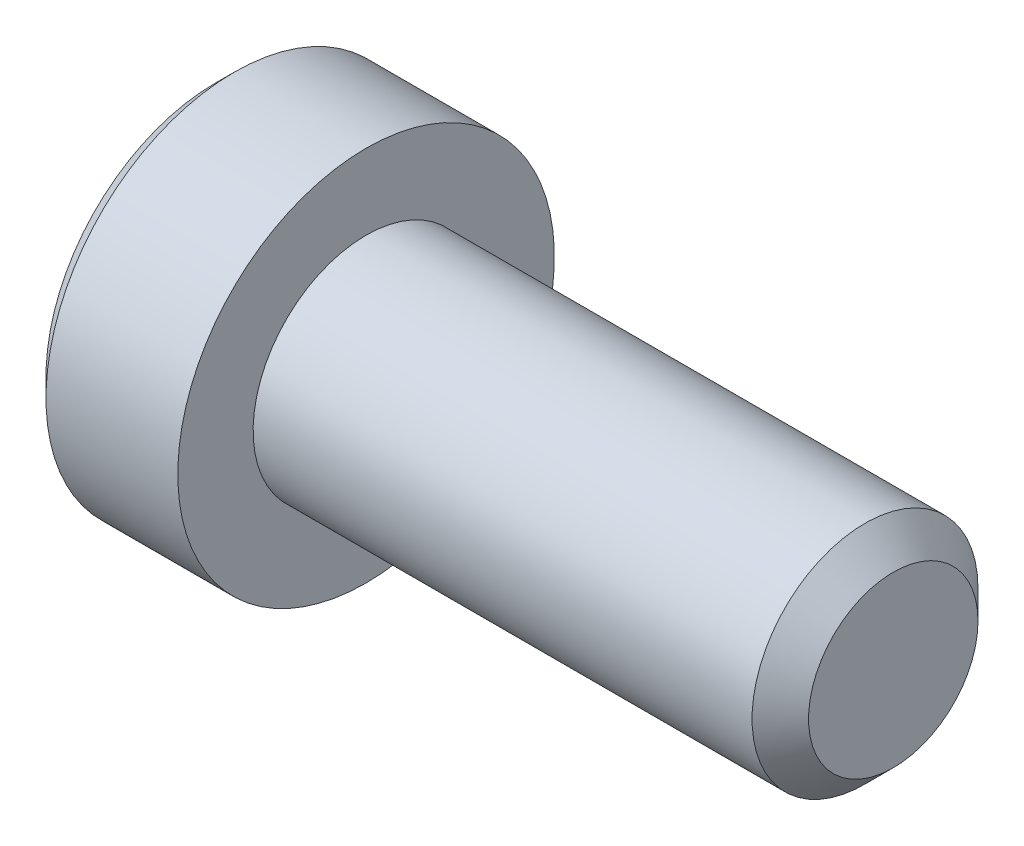
ISO-10303-21;
HEADER;
FILE_DESCRIPTION(('STEP AP214'),'2;1');
FILE_NAME('part.step','',(''),(''),'','','');
FILE_SCHEMA(('AUTOMOTIVE_DESIGN { 1 0 10303 214 1 1 1 1 }'));
ENDSEC;
DATA;
#1=APPLICATION_CONTEXT('core data for automotive mechanical design processes');
#2=APPLICATION_PROTOCOL_DEFINITION('international standard','automotive_design',2000,#1);
#3=PRODUCT_CONTEXT('',#1,'mechanical');
#4=PRODUCT('Part','Part','',(#3));
#5=PRODUCT_RELATED_PRODUCT_CATEGORY('part','',(#4));
#6=PRODUCT_DEFINITION_FORMATION('','',#4);
#7=PRODUCT_DEFINITION_CONTEXT('part definition',#1,'design');
#8=PRODUCT_DEFINITION('design','',#6,#7);
#9=PRODUCT_DEFINITION_SHAPE('','',#8);
#10=(LENGTH_UNIT() NAMED_UNIT(*) SI_UNIT(.MILLI.,.METRE.));
#11=(NAMED_UNIT(*) PLANE_ANGLE_UNIT() SI_UNIT($,.RADIAN.));
#12=(NAMED_UNIT(*) SI_UNIT($,.STERADIAN.) SOLID_ANGLE_UNIT());
#13=UNCERTAINTY_MEASURE_WITH_UNIT(LENGTH_MEASURE(1.E-05),#10,'distance_accuracy_value','');
#14=(GEOMETRIC_REPRESENTATION_CONTEXT(3) GLOBAL_UNCERTAINTY_ASSIGNED_CONTEXT((#13)) GLOBAL_UNIT_ASSIGNED_CONTEXT((#10,
#11,#12)) REPRESENTATION_CONTEXT('',''));
#15=CARTESIAN_POINT('',(0.,0.,0.));
#16=DIRECTION('',(0.,0.,1.));
#17=DIRECTION('',(1.,0.,0.));
#18=AXIS2_PLACEMENT_3D('',#15,#16,#17);
#19=CARTESIAN_POINT('',(-11.,4.49999999999999,0.));
#20=DIRECTION('',(-1.,0.,0.));
#21=DIRECTION('',(0.,-1.,0.));
#22=AXIS2_PLACEMENT_3D('',#19,#20,#21);
#23=PLANE('',#22);
#24=CARTESIAN_POINT('',(-11.,0.,0.));
#25=DIRECTION('',(-1.,0.,0.));
#26=DIRECTION('',(0.,-1.,0.));
#27=AXIS2_PLACEMENT_3D('',#24,#25,#26);
#28=CIRCLE('',#27,2.30940107675845);
#29=CARTESIAN_POINT('',(-11.,-2.30940107675842,-1.43331527202584E-13));
#30=VERTEX_POINT('',#29);
#31=CARTESIAN_POINT('',(-11.,-1.15470053837932,1.99999999999988));
#32=VERTEX_POINT('',#31);
#33=EDGE_CURVE('E131',#30,#32,#28,.T.);
#34=ORIENTED_EDGE('',*,*,#33,.F.);
#35=CARTESIAN_POINT('',(-11.,-1.15470053837925,-2.));
#36=VERTEX_POINT('',#35);
#37=EDGE_CURVE('E130',#36,#30,#28,.T.);
#38=ORIENTED_EDGE('',*,*,#37,.F.);
#39=CARTESIAN_POINT('',(-11.,1.15470053837917,-2.));
#40=VERTEX_POINT('',#39);
#41=EDGE_CURVE('E100',#40,#36,#28,.T.);
#42=ORIENTED_EDGE('',*,*,#41,.F.);
#43=CARTESIAN_POINT('',(-11.,2.30940107675848,0.));
#44=VERTEX_POINT('',#43);
#45=EDGE_CURVE('E93',#44,#40,#28,.T.);
#46=ORIENTED_EDGE('',*,*,#45,.F.);
#47=CARTESIAN_POINT('',(-11.,1.15470053837917,2.));
#48=VERTEX_POINT('',#47);
#49=EDGE_CURVE('E54',#48,#44,#28,.T.);
#50=ORIENTED_EDGE('',*,*,#49,.F.);
#51=EDGE_CURVE('E61',#32,#48,#28,.T.);
#52=ORIENTED_EDGE('',*,*,#51,.F.);
#53=EDGE_LOOP('',(#34,#38,#42,#46,#50,#52));
#54=FACE_BOUND('',#53,.T.);
#55=CARTESIAN_POINT('',(-11.,0.,0.));
#56=DIRECTION('',(1.,0.,0.));
#57=DIRECTION('',(0.,1.,0.));
#58=AXIS2_PLACEMENT_3D('',#55,#56,#57);
#59=CIRCLE('',#58,4.49999999999999);
#60=CARTESIAN_POINT('',(-11.,4.49999999999999,0.));
#61=VERTEX_POINT('',#60);
#62=EDGE_CURVE('E220',#61,#61,#59,.T.);
#63=ORIENTED_EDGE('',*,*,#62,.F.);
#64=EDGE_LOOP('',(#63));
#65=FACE_BOUND('',#64,.T.);
#66=ADVANCED_FACE('F34',(#54,#65),#23,.T.);
#67=CARTESIAN_POINT('',(-7.,0.,0.));
#68=DIRECTION('',(1.,0.,0.));
#69=DIRECTION('',(0.,0.,-1.));
#70=AXIS2_PLACEMENT_3D('',#67,#68,#69);
#71=CYLINDRICAL_SURFACE('',#70,3.);
#72=CARTESIAN_POINT('',(6.25,0.,0.));
#73=DIRECTION('',(1.,0.,0.));
#74=DIRECTION('',(0.,0.,-1.));
#75=AXIS2_PLACEMENT_3D('',#72,#73,#74);
#76=CIRCLE('',#75,3.);
#77=CARTESIAN_POINT('',(6.25,0.,-3.));
#78=VERTEX_POINT('',#77);
#79=EDGE_CURVE('E48',#78,#78,#76,.F.);
#80=ORIENTED_EDGE('',*,*,#79,.T.);
#81=EDGE_LOOP('',(#80));
#82=FACE_BOUND('',#81,.T.);
#83=CARTESIAN_POINT('',(-7.,0.,0.));
#84=DIRECTION('',(1.,0.,0.));
#85=DIRECTION('',(0.,1.,0.));
#86=AXIS2_PLACEMENT_3D('',#83,#84,#85);
#87=CIRCLE('',#86,3.);
#88=CARTESIAN_POINT('',(-7.,2.99999999999999,0.));
#89=VERTEX_POINT('',#88);
#90=EDGE_CURVE('E213',#89,#89,#87,.F.);
#91=ORIENTED_EDGE('',*,*,#90,.F.);
#92=EDGE_LOOP('',(#91));
#93=FACE_BOUND('',#92,.T.);
#94=ADVANCED_FACE('F193',(#82,#93),#71,.T.);
#95=CARTESIAN_POINT('',(7.,0.,0.));
#96=DIRECTION('',(1.,0.,0.));
#97=DIRECTION('',(0.,0.,-1.));
#98=AXIS2_PLACEMENT_3D('',#95,#96,#97);
#99=PLANE('',#98);
#100=CARTESIAN_POINT('',(7.,0.,0.));
#101=DIRECTION('',(1.,0.,0.));
#102=DIRECTION('',(0.,0.,-1.));
#103=AXIS2_PLACEMENT_3D('',#100,#101,#102);
#104=CIRCLE('',#103,2.25);
#105=CARTESIAN_POINT('',(7.,0.,-2.25));
#106=VERTEX_POINT('',#105);
#107=EDGE_CURVE('E214',#106,#106,#104,.T.);
#108=ORIENTED_EDGE('',*,*,#107,.T.);
#109=EDGE_LOOP('',(#108));
#110=FACE_BOUND('',#109,.T.);
#111=ADVANCED_FACE('F201',(#110),#99,.T.);
#112=CARTESIAN_POINT('',(7.,0.,0.));
#113=DIRECTION('',(-1.,0.,0.));
#114=DIRECTION('',(0.,0.,1.));
#115=AXIS2_PLACEMENT_3D('',#112,#113,#114);
#116=CONICAL_SURFACE('',#115,2.25,0.785398163397445);
#117=ORIENTED_EDGE('',*,*,#79,.F.);
#118=EDGE_LOOP('',(#117));
#119=FACE_BOUND('',#118,.T.);
#120=ORIENTED_EDGE('',*,*,#107,.F.);
#121=EDGE_LOOP('',(#120));
#122=FACE_BOUND('',#121,.T.);
#123=ADVANCED_FACE('F36',(#119,#122),#116,.T.);
#124=CARTESIAN_POINT('',(-7.,0.,0.));
#125=DIRECTION('',(1.,0.,0.));
#126=DIRECTION('',(0.,1.,0.));
#127=AXIS2_PLACEMENT_3D('',#124,#125,#126);
#128=CYLINDRICAL_SURFACE('',#127,5.);
#129=CARTESIAN_POINT('',(-10.5,0.,0.));
#130=DIRECTION('',(1.,0.,0.));
#131=DIRECTION('',(0.,1.,0.));
#132=AXIS2_PLACEMENT_3D('',#129,#130,#131);
#133=CIRCLE('',#132,5.);
#134=CARTESIAN_POINT('',(-10.5,5.,0.));
#135=VERTEX_POINT('',#134);
#136=EDGE_CURVE('E215',#135,#135,#133,.T.);
#137=ORIENTED_EDGE('',*,*,#136,.T.);
#138=EDGE_LOOP('',(#137));
#139=FACE_BOUND('',#138,.T.);
#140=CARTESIAN_POINT('',(-7.,0.,0.));
#141=DIRECTION('',(1.,0.,0.));
#142=DIRECTION('',(0.,1.,0.));
#143=AXIS2_PLACEMENT_3D('',#140,#141,#142);
#144=CIRCLE('',#143,5.);
#145=CARTESIAN_POINT('',(-7.,5.,0.));
#146=VERTEX_POINT('',#145);
#147=EDGE_CURVE('E225',#146,#146,#144,.T.);
#148=ORIENTED_EDGE('',*,*,#147,.F.);
#149=EDGE_LOOP('',(#148));
#150=FACE_BOUND('',#149,.T.);
#151=ADVANCED_FACE('F196',(#139,#150),#128,.T.);
#152=CARTESIAN_POINT('',(-10.5,0.,0.));
#153=DIRECTION('',(1.,0.,0.));
#154=DIRECTION('',(0.,1.,0.));
#155=AXIS2_PLACEMENT_3D('',#152,#153,#154);
#156=CONICAL_SURFACE('',#155,5.,0.78539816339745);
#157=ORIENTED_EDGE('',*,*,#62,.T.);
#158=EDGE_LOOP('',(#157));
#159=FACE_BOUND('',#158,.T.);
#160=ORIENTED_EDGE('',*,*,#136,.F.);
#161=EDGE_LOOP('',(#160));
#162=FACE_BOUND('',#161,.T.);
#163=ADVANCED_FACE('F189',(#159,#162),#156,.T.);
#164=CARTESIAN_POINT('',(-7.,5.,0.));
#165=DIRECTION('',(1.,0.,0.));
#166=DIRECTION('',(0.,1.,0.));
#167=AXIS2_PLACEMENT_3D('',#164,#165,#166);
#168=PLANE('',#167);
#169=ORIENTED_EDGE('',*,*,#90,.T.);
#170=EDGE_LOOP('',(#169));
#171=FACE_BOUND('',#170,.T.);
#172=ORIENTED_EDGE('',*,*,#147,.T.);
#173=EDGE_LOOP('',(#172));
#174=FACE_BOUND('',#173,.T.);
#175=ADVANCED_FACE('F153',(#171,#174),#168,.T.);
#176=CARTESIAN_POINT('',(-11.,0.,0.));
#177=DIRECTION('',(-1.,0.,0.));
#178=DIRECTION('',(0.,-1.,0.));
#179=AXIS2_PLACEMENT_3D('',#176,#177,#178);
#180=CONICAL_SURFACE('',#179,2.30940107675845,0.78539816339745);
#181=CARTESIAN_POINT('',(-11.7407713552808,-2.30294417326428,-2.));
#182=CARTESIAN_POINT('',(-11.6984432738693,-2.24687002696276,-2.));
#183=CARTESIAN_POINT('',(-11.6565251570979,-2.1904819056858,-2.));
#184=CARTESIAN_POINT('',(-11.5736904180752,-2.0769539052615,-2.));
#185=CARTESIAN_POINT('',(-11.5327740498726,-2.01981384095227,-2.));
#186=CARTESIAN_POINT('',(-11.4518334522037,-1.90424016831612,-2.));
#187=CARTESIAN_POINT('',(-11.4118185917352,-1.84579996769761,-2.));
#188=CARTESIAN_POINT('',(-11.3332889938203,-1.72792745485623,-2.));
#189=CARTESIAN_POINT('',(-11.2947741503896,-1.66849521315184,-2.));
#190=CARTESIAN_POINT('',(-11.1776406517203,-1.48162995729571,-2.));
#191=CARTESIAN_POINT('',(-11.1021459018253,-1.35220318180734,-2.));
#192=CARTESIAN_POINT('',(-10.9640493510524,-1.08689521605217,-2.));
#193=CARTESIAN_POINT('',(-10.9014040859441,-0.951037764035602,-2.));
#194=CARTESIAN_POINT('',(-10.8247635439028,-0.747111912337623,-2.));
#195=CARTESIAN_POINT('',(-10.8027671799473,-0.682064034234129,-2.));
#196=CARTESIAN_POINT('',(-10.7639966876877,-0.550398103397345,-2.));
#197=CARTESIAN_POINT('',(-10.7472229191476,-0.483779942833369,-2.));
#198=CARTESIAN_POINT('',(-10.7200482579068,-0.350484328974877,-2.));
#199=CARTESIAN_POINT('',(-10.709538176761,-0.283829489500032,-2.));
#200=CARTESIAN_POINT('',(-10.6950960855565,-0.149806987290402,-2.));
#201=CARTESIAN_POINT('',(-10.69116294474,-0.0824394490929016,-2.));
#202=CARTESIAN_POINT('',(-10.6901664769297,0.0499055621214018,-2.));
#203=CARTESIAN_POINT('',(-10.6928596448403,0.114881284963511,-2.));
#204=CARTESIAN_POINT('',(-10.7044300703996,0.24427592129061,-2.));
#205=CARTESIAN_POINT('',(-10.7133079288032,0.308694780068688,-2.));
#206=CARTESIAN_POINT('',(-10.7369136592515,0.437599788400961,-2.));
#207=CARTESIAN_POINT('',(-10.7517410833942,0.502067428429106,-2.));
#208=CARTESIAN_POINT('',(-10.7864578835601,0.629594322371882,-2.));
#209=CARTESIAN_POINT('',(-10.8063468360305,0.692653693651535,-2.));
#210=CARTESIAN_POINT('',(-10.8764469791435,0.89118788892849,-2.));
#211=CARTESIAN_POINT('',(-10.9346418001747,1.02383545674829,-2.));
#212=CARTESIAN_POINT('',(-11.0640305752409,1.2829093210938,-2.));
#213=CARTESIAN_POINT('',(-11.1352712311583,1.40931112542934,-2.));
#214=CARTESIAN_POINT('',(-11.2464419915628,1.59200441388856,-2.));
#215=CARTESIAN_POINT('',(-11.2831821900084,1.65027548974483,-2.));
#216=CARTESIAN_POINT('',(-11.3582145138206,1.76581760334356,-2.));
#217=CARTESIAN_POINT('',(-11.3965067567377,1.8230885648664,-2.));
#218=CARTESIAN_POINT('',(-11.4740422636668,1.93629654702502,-2.));
#219=CARTESIAN_POINT('',(-11.5132752757023,1.99224062439416,-2.));
#220=CARTESIAN_POINT('',(-11.5927788302714,2.10336423965707,-2.));
#221=CARTESIAN_POINT('',(-11.6330490845185,2.15854398356745,-2.));
#222=CARTESIAN_POINT('',(-11.673744237647,2.21340370625408,-2.));
#223=B_SPLINE_CURVE_WITH_KNOTS('',3,(#181,#182,#183,#184,#185,#186,#187,#188,#189,#190,#191,
#192,#193,#194,#195,#196,#197,#198,#199,#200,#201,#202,#203,#204,#205,#206,#207,#208,#209,#210,
#211,#212,#213,#214,#215,#216,#217,#218,#219,#220,#221,#222),.UNSPECIFIED.,.F.,.F.,(4,2,2,2,2,2,
2,2,2,2,2,2,2,2,2,2,2,2,2,2,4),(0.,0.210772732017011,0.42159837473884,0.634057554744624,
0.846501696032185,1.29562155480994,1.74319622856097,1.94902062142335,2.15485918958133,
2.35699582530217,2.55909770457496,2.75388435576875,2.94868993036095,3.1469009347167,
3.34509535806592,3.77838155838772,4.21325029906867,4.41989056664097,4.62654651432579,
4.83152377076248,5.03644465872345),.UNSPECIFIED.);
#224=EDGE_CURVE('E11',#36,#40,#223,.T.);
#225=ORIENTED_EDGE('',*,*,#224,.T.);
#226=ORIENTED_EDGE('',*,*,#41,.T.);
#227=EDGE_LOOP('',(#225,#226));
#228=FACE_BOUND('',#227,.T.);
#229=ADVANCED_FACE('F105',(#228),#180,.F.);
#230=CARTESIAN_POINT('',(-11.0001154787138,-2.30951654681234,0.000200000000000547));
#231=CARTESIAN_POINT('',(-10.9604530902257,-2.26982196410711,-0.0685530340307058));
#232=CARTESIAN_POINT('',(-10.9231199822843,-2.22946361676571,-0.138455742135513));
#233=CARTESIAN_POINT('',(-10.8547636851362,-2.1471683966763,-0.28099524455044));
#234=CARTESIAN_POINT('',(-10.8237785337373,-2.10522369580641,-0.353645597565363));
#235=CARTESIAN_POINT('',(-10.7707002165442,-2.02064418875706,-0.500141601053978));
#236=CARTESIAN_POINT('',(-10.7484736271767,-1.97803092714268,-0.573949935246302));
#237=CARTESIAN_POINT('',(-10.7142288166752,-1.89186619344272,-0.723191631835273));
#238=CARTESIAN_POINT('',(-10.7021850291442,-1.84831735425552,-0.798620433918162));
#239=CARTESIAN_POINT('',(-10.6913185119057,-1.77326466747239,-0.928615500671091));
#240=CARTESIAN_POINT('',(-10.6897097536101,-1.74185780396624,-0.983013783970121));
#241=CARTESIAN_POINT('',(-10.6924188775988,-1.67909540053411,-1.09172145551971));
#242=CARTESIAN_POINT('',(-10.6967388377581,-1.64773988246021,-1.14603080592135));
#243=CARTESIAN_POINT('',(-10.71105956741,-1.58532489948419,-1.25413672758935));
#244=CARTESIAN_POINT('',(-10.7210666927621,-1.55426580541468,-1.30793265655481));
#245=CARTESIAN_POINT('',(-10.7462124302497,-1.49268469862227,-1.41459426230559));
#246=CARTESIAN_POINT('',(-10.7613506490423,-1.46216264491916,-1.46746001007073));
#247=CARTESIAN_POINT('',(-10.8062945034293,-1.38397803138048,-1.60287973308986));
#248=CARTESIAN_POINT('',(-10.8394888394259,-1.33680037273297,-1.68459383484949));
#249=CARTESIAN_POINT('',(-10.8955258231714,-1.26742988897853,-1.80474703725781));
#250=CARTESIAN_POINT('',(-10.915214702947,-1.2445692346153,-1.84434285210918));
#251=CARTESIAN_POINT('',(-10.9563873183649,-1.19927142554652,-1.92280095888788));
#252=CARTESIAN_POINT('',(-10.9778699516513,-1.17683402097614,-1.96166368359374));
#253=CARTESIAN_POINT('',(-11.0001154787137,-1.15458506832541,-2.0002));
#254=B_SPLINE_CURVE_WITH_KNOTS('',3,(#230,#231,#232,#233,#234,#235,#236,#237,#238,#239,#240,
#241,#242,#243,#244,#245,#246,#247,#248,#249,#250,#251,#252,#253),.UNSPECIFIED.,.F.,.F.,(4,2,2,
2,2,2,2,2,2,2,2,4),(0.,0.266420613771068,0.534393751523397,0.798110374376926,1.06116288956938,
1.24939906803723,1.43770123566249,1.62621426093934,1.81471283831916,2.11415604834146,
2.26347170717791,2.41269626969771),.UNSPECIFIED.);
#255=EDGE_CURVE('E133',#30,#36,#254,.T.);
#256=ORIENTED_EDGE('',*,*,#255,.T.);
#257=ORIENTED_EDGE('',*,*,#37,.T.);
#258=EDGE_LOOP('',(#256,#257));
#259=FACE_BOUND('',#258,.T.);
#260=ADVANCED_FACE('F152',(#259),#180,.F.);
#261=CARTESIAN_POINT('',(-11.0001154787137,-1.15458506832541,2.0002));
#262=CARTESIAN_POINT('',(-10.9604530902257,-1.19427965103064,1.9314469659693));
#263=CARTESIAN_POINT('',(-10.9231199822842,-1.23463799837204,1.86154425786449));
#264=CARTESIAN_POINT('',(-10.8547636851362,-1.31693321846145,1.71900475544957));
#265=CARTESIAN_POINT('',(-10.8237785337373,-1.35887791933134,1.64635440243465));
#266=CARTESIAN_POINT('',(-10.7707002165442,-1.44345742638069,1.49985839894603));
#267=CARTESIAN_POINT('',(-10.7484736271767,-1.48607068799506,1.42605006475371));
#268=CARTESIAN_POINT('',(-10.7142288166752,-1.57223542169502,1.27680836816474));
#269=CARTESIAN_POINT('',(-10.7021850291442,-1.61578426088223,1.20137956608186));
#270=CARTESIAN_POINT('',(-10.6913185119057,-1.69083694766535,1.07138449932893));
#271=CARTESIAN_POINT('',(-10.6897097536101,-1.7222438111715,1.0169862160299));
#272=CARTESIAN_POINT('',(-10.6924188775988,-1.78500621460363,0.908278544480315));
#273=CARTESIAN_POINT('',(-10.6967388377581,-1.81636173267754,0.853969194078669));
#274=CARTESIAN_POINT('',(-10.71105956741,-1.87877671565355,0.745863272410669));
#275=CARTESIAN_POINT('',(-10.7210666927621,-1.90983580972306,0.692067343445214));
#276=CARTESIAN_POINT('',(-10.7462124302497,-1.97141691651547,0.585405737694432));
#277=CARTESIAN_POINT('',(-10.7613506490423,-2.00193897021859,0.532539989929293));
#278=CARTESIAN_POINT('',(-10.8062945034293,-2.08012358375727,0.39712026691016));
#279=CARTESIAN_POINT('',(-10.8394888394259,-2.12730124240478,0.315406165150525));
#280=CARTESIAN_POINT('',(-10.8955258231715,-2.19667172615922,0.1952529627422));
#281=CARTESIAN_POINT('',(-10.915214702947,-2.21953238052245,0.155657147890825));
#282=CARTESIAN_POINT('',(-10.956387318365,-2.26483018959123,0.0771990411121291));
#283=CARTESIAN_POINT('',(-10.9778699516513,-2.28726759416161,0.0383363164062603));
#284=CARTESIAN_POINT('',(-11.0001154787138,-2.30951654681234,-0.000199999999999789));
#285=B_SPLINE_CURVE_WITH_KNOTS('',3,(#261,#262,#263,#264,#265,#266,#267,#268,#269,#270,#271,
#272,#273,#274,#275,#276,#277,#278,#279,#280,#281,#282,#283,#284),.UNSPECIFIED.,.F.,.F.,(4,2,2,
2,2,2,2,2,2,2,2,4),(0.,0.266420613771059,0.534393751523381,0.798110374376903,1.06116288956935,
1.2493990680372,1.43770123566246,1.62621426093931,1.81471283831912,2.11415604834144,
2.2634717071779,2.41269626969771),.UNSPECIFIED.);
#286=EDGE_CURVE('E140',#32,#30,#285,.T.);
#287=ORIENTED_EDGE('',*,*,#286,.T.);
#288=ORIENTED_EDGE('',*,*,#33,.T.);
#289=EDGE_LOOP('',(#287,#288));
#290=FACE_BOUND('',#289,.T.);
#291=ADVANCED_FACE('F258',(#290),#180,.F.);
#292=CARTESIAN_POINT('',(-11.7407713550278,-2.30294417292921,2.));
#293=CARTESIAN_POINT('',(-11.698443273626,-2.2468700266371,2.));
#294=CARTESIAN_POINT('',(-11.6565251568644,-2.19048190536957,2.));
#295=CARTESIAN_POINT('',(-11.5736904178611,-2.07695390496422,2.));
#296=CARTESIAN_POINT('',(-11.5327740496681,-2.01981384066452,2.));
#297=CARTESIAN_POINT('',(-11.4518334520186,-1.90424016804774,2.));
#298=CARTESIAN_POINT('',(-11.4118185915599,-1.84579996743908,2.));
#299=CARTESIAN_POINT('',(-11.3332889936644,-1.72792745461758,2.));
#300=CARTESIAN_POINT('',(-11.2947741502432,-1.66849521292322,2.));
#301=CARTESIAN_POINT('',(-11.1776406516044,-1.48162995710017,2.));
#302=CARTESIAN_POINT('',(-11.1021459017297,-1.35220318163534,2.));
#303=CARTESIAN_POINT('',(-10.9640493509944,-1.08689521592922,2.));
#304=CARTESIAN_POINT('',(-10.9014040859036,-0.951037763938167,2.));
#305=CARTESIAN_POINT('',(-10.8247635438752,-0.747111912259384,2.));
#306=CARTESIAN_POINT('',(-10.8027671799192,-0.682064034147851,2.));
#307=CARTESIAN_POINT('',(-10.7639966876602,-0.550398103294727,2.));
#308=CARTESIAN_POINT('',(-10.7472229191212,-0.483779942722451,2.));
#309=CARTESIAN_POINT('',(-10.7200482578845,-0.35048432884763,2.));
#310=CARTESIAN_POINT('',(-10.7095381767417,-0.283829489364761,2.));
#311=CARTESIAN_POINT('',(-10.695096085545,-0.149806987139352,2.));
#312=CARTESIAN_POINT('',(-10.6911629447332,-0.0824394489340971,2.));
#313=CARTESIAN_POINT('',(-10.6901664769338,0.049905562294515,2.));
#314=CARTESIAN_POINT('',(-10.6928596448505,0.114881285143198,2.));
#315=CARTESIAN_POINT('',(-10.7044300704227,0.244275921482787,2.));
#316=CARTESIAN_POINT('',(-10.7133079288333,0.308694780266779,2.));
#317=CARTESIAN_POINT('',(-10.7369136592962,0.437599788610731,2.));
#318=CARTESIAN_POINT('',(-10.7517410834466,0.502067428644622,2.));
#319=CARTESIAN_POINT('',(-10.786457883628,0.629594322598333,2.));
#320=CARTESIAN_POINT('',(-10.8063468361063,0.692653693883178,2.));
#321=CARTESIAN_POINT('',(-10.8764469792563,0.891187889210572,2.));
#322=CARTESIAN_POINT('',(-10.9346418003216,1.02383545707309,2.));
#323=CARTESIAN_POINT('',(-11.0640305754596,1.28290932150077,2.));
#324=CARTESIAN_POINT('',(-11.1352712314149,1.40931112587573,2.));
#325=CARTESIAN_POINT('',(-11.2464419918748,1.59200441438966,2.));
#326=CARTESIAN_POINT('',(-11.2831821903374,1.65027549026194,2.));
#327=CARTESIAN_POINT('',(-11.3582145141838,1.76581760389245,2.));
#328=CARTESIAN_POINT('',(-11.3965067571181,1.82308856543107,2.));
#329=CARTESIAN_POINT('',(-11.4740422640813,1.93629654762087,2.));
#330=CARTESIAN_POINT('',(-11.5132752761336,1.99224062500541,2.));
#331=CARTESIAN_POINT('',(-11.5927788307366,2.10336424029903,2.));
#332=CARTESIAN_POINT('',(-11.6330490850006,2.15854398422471,2.));
#333=CARTESIAN_POINT('',(-11.673744238146,2.21340370692661,2.));
#334=B_SPLINE_CURVE_WITH_KNOTS('',3,(#292,#293,#294,#295,#296,#297,#298,#299,#300,#301,#302,
#303,#304,#305,#306,#307,#308,#309,#310,#311,#312,#313,#314,#315,#316,#317,#318,#319,#320,#321,
#322,#323,#324,#325,#326,#327,#328,#329,#330,#331,#332,#333),.UNSPECIFIED.,.F.,.F.,(4,2,2,2,2,2,
2,2,2,2,2,2,2,2,2,2,2,2,2,2,4),(0.,0.210772731976892,0.421598374658592,0.634057554623491,
0.846501695870175,1.29562155455625,1.74319622821646,1.94902062110208,2.15485918928326,
2.35699582502636,2.55909770432141,2.75388435553557,2.94868993014816,3.14690093452587,
3.34509535789703,3.77838155837655,4.21325029921626,4.41989056685648,4.62654651460922,
4.8315237711129,5.03644465914086),.UNSPECIFIED.);
#335=EDGE_CURVE('E160',#48,#32,#334,.F.);
#336=ORIENTED_EDGE('',*,*,#335,.T.);
#337=ORIENTED_EDGE('',*,*,#51,.T.);
#338=EDGE_LOOP('',(#336,#337));
#339=FACE_BOUND('',#338,.T.);
#340=ADVANCED_FACE('F274',(#339),#180,.F.);
#341=CARTESIAN_POINT('',(-11.0001154787137,2.30951654681234,-0.000199999999999966));
#342=CARTESIAN_POINT('',(-10.9604530902256,2.26982196410711,0.0685530340307046));
#343=CARTESIAN_POINT('',(-10.9231199822842,2.22946361676572,0.13845574213551));
#344=CARTESIAN_POINT('',(-10.8547636851362,2.14716839667631,0.280995244550433));
#345=CARTESIAN_POINT('',(-10.8237785337372,2.10522369580642,0.353645597565355));
#346=CARTESIAN_POINT('',(-10.7707002165442,2.02064418875707,0.500141601053966));
#347=CARTESIAN_POINT('',(-10.7484736271766,1.97803092714269,0.573949935246288));
#348=CARTESIAN_POINT('',(-10.7142288166751,1.89186619344273,0.723191631835256));
#349=CARTESIAN_POINT('',(-10.7021850291442,1.84831735425553,0.798620433918143));
#350=CARTESIAN_POINT('',(-10.6913185119056,1.7732646674724,0.928615500671069));
#351=CARTESIAN_POINT('',(-10.68970975361,1.74185780396625,0.983013783970098));
#352=CARTESIAN_POINT('',(-10.6924188775987,1.67909540053412,1.09172145551968));
#353=CARTESIAN_POINT('',(-10.696738837758,1.64773988246022,1.14603080592133));
#354=CARTESIAN_POINT('',(-10.7110595674099,1.58532489948421,1.25413672758933));
#355=CARTESIAN_POINT('',(-10.721066692762,1.5542658054147,1.30793265655478));
#356=CARTESIAN_POINT('',(-10.7462124302497,1.49268469862229,1.41459426230556));
#357=CARTESIAN_POINT('',(-10.7613506490423,1.46216264491917,1.4674600100707));
#358=CARTESIAN_POINT('',(-10.8062945034292,1.38397803138049,1.60287973308983));
#359=CARTESIAN_POINT('',(-10.8394888394258,1.33680037273298,1.68459383484947));
#360=CARTESIAN_POINT('',(-10.8955258231714,1.26742988897853,1.8047470372578));
#361=CARTESIAN_POINT('',(-10.915214702947,1.24456923461531,1.84434285210917));
#362=CARTESIAN_POINT('',(-10.9563873183649,1.19927142554652,1.92280095888787));
#363=CARTESIAN_POINT('',(-10.9778699516513,1.17683402097614,1.96166368359374));
#364=CARTESIAN_POINT('',(-11.0001154787137,1.15458506832541,2.0002));
#365=B_SPLINE_CURVE_WITH_KNOTS('',3,(#341,#342,#343,#344,#345,#346,#347,#348,#349,#350,#351,
#352,#353,#354,#355,#356,#357,#358,#359,#360,#361,#362,#363,#364),.UNSPECIFIED.,.F.,.F.,(4,2,2,
2,2,2,2,2,2,2,2,4),(0.,0.26642061377106,0.534393751523382,0.798110374376904,1.06116288956935,
1.2493990680372,1.43770123566246,1.6262142609393,1.81471283831911,2.11415604834144,
2.2634717071779,2.41269626969771),.UNSPECIFIED.);
#366=EDGE_CURVE('E120',#44,#48,#365,.T.);
#367=ORIENTED_EDGE('',*,*,#366,.T.);
#368=ORIENTED_EDGE('',*,*,#49,.T.);
#369=EDGE_LOOP('',(#367,#368));
#370=FACE_BOUND('',#369,.T.);
#371=ADVANCED_FACE('F250',(#370),#180,.F.);
#372=CARTESIAN_POINT('',(-11.0001154787137,1.15458506832541,-2.0002));
#373=CARTESIAN_POINT('',(-10.9604530902256,1.19427965103065,-1.93144696596929));
#374=CARTESIAN_POINT('',(-10.9231199822842,1.23463799837204,-1.86154425786449));
#375=CARTESIAN_POINT('',(-10.8547636851362,1.31693321846145,-1.71900475544956));
#376=CARTESIAN_POINT('',(-10.8237785337373,1.35887791933134,-1.64635440243464));
#377=CARTESIAN_POINT('',(-10.7707002165442,1.4434574263807,-1.49985839894602));
#378=CARTESIAN_POINT('',(-10.7484736271766,1.48607068799507,-1.4260500647537));
#379=CARTESIAN_POINT('',(-10.7142288166751,1.57223542169503,-1.27680836816473));
#380=CARTESIAN_POINT('',(-10.7021850291442,1.61578426088224,-1.20137956608184));
#381=CARTESIAN_POINT('',(-10.6913185119056,1.69083694766536,-1.07138449932891));
#382=CARTESIAN_POINT('',(-10.68970975361,1.72224381117151,-1.01698621602988));
#383=CARTESIAN_POINT('',(-10.6924188775987,1.78500621460364,-0.908278544480297));
#384=CARTESIAN_POINT('',(-10.696738837758,1.81636173267755,-0.853969194078652));
#385=CARTESIAN_POINT('',(-10.7110595674099,1.87877671565356,-0.745863272410654));
#386=CARTESIAN_POINT('',(-10.721066692762,1.90983580972307,-0.6920673434452));
#387=CARTESIAN_POINT('',(-10.7462124302497,1.97141691651548,-0.58540573769442));
#388=CARTESIAN_POINT('',(-10.7613506490423,2.00193897021859,-0.532539989929281));
#389=CARTESIAN_POINT('',(-10.8062945034292,2.08012358375727,-0.397120266910151));
#390=CARTESIAN_POINT('',(-10.8394888394258,2.12730124240478,-0.315406165150517));
#391=CARTESIAN_POINT('',(-10.8955258231714,2.19667172615922,-0.195252962742195));
#392=CARTESIAN_POINT('',(-10.915214702947,2.21953238052245,-0.155657147890821));
#393=CARTESIAN_POINT('',(-10.9563873183649,2.26483018959124,-0.0771990411121267));
#394=CARTESIAN_POINT('',(-10.9778699516513,2.28726759416161,-0.0383363164062592));
#395=CARTESIAN_POINT('',(-11.0001154787137,2.30951654681234,0.000200000000000089));
#396=B_SPLINE_CURVE_WITH_KNOTS('',3,(#372,#373,#374,#375,#376,#377,#378,#379,#380,#381,#382,
#383,#384,#385,#386,#387,#388,#389,#390,#391,#392,#393,#394,#395),.UNSPECIFIED.,.F.,.F.,(4,2,2,
2,2,2,2,2,2,2,2,4),(0.,0.266420613771067,0.534393751523396,0.798110374376925,1.06116288956938,
1.24939906803723,1.43770123566249,1.62621426093933,1.81471283831914,2.11415604834145,
2.26347170717791,2.41269626969771),.UNSPECIFIED.);
#397=EDGE_CURVE('E96',#40,#44,#396,.T.);
#398=ORIENTED_EDGE('',*,*,#397,.T.);
#399=ORIENTED_EDGE('',*,*,#45,.T.);
#400=EDGE_LOOP('',(#398,#399));
#401=FACE_BOUND('',#400,.T.);
#402=ADVANCED_FACE('F94',(#401),#180,.F.);
#403=CARTESIAN_POINT('',(-7.88,2.3094010767585,0.));
#404=DIRECTION('',(1.,0.,0.));
#405=DIRECTION('',(0.,0.,-1.));
#406=AXIS2_PLACEMENT_3D('',#403,#404,#405);
#407=PLANE('',#406);
#408=DIRECTION('',(0.,0.5,0.866025403784439));
#409=VECTOR('',#408,1.);
#410=CARTESIAN_POINT('',(-7.88,1.15470053837925,-2.));
#411=LINE('',#410,#409);
#412=CARTESIAN_POINT('',(-7.88,1.15470053837925,-2.));
#413=VERTEX_POINT('',#412);
#414=CARTESIAN_POINT('',(-7.88,2.3094010767585,0.));
#415=VERTEX_POINT('',#414);
#416=EDGE_CURVE('E119',#413,#415,#411,.T.);
#417=ORIENTED_EDGE('',*,*,#416,.F.);
#418=DIRECTION('',(0.,1.,0.));
#419=VECTOR('',#418,1.);
#420=CARTESIAN_POINT('',(-7.88,-1.15470053837925,-2.));
#421=LINE('',#420,#419);
#422=CARTESIAN_POINT('',(-7.88,-1.15470053837925,-2.));
#423=VERTEX_POINT('',#422);
#424=EDGE_CURVE('E124',#423,#413,#421,.T.);
#425=ORIENTED_EDGE('',*,*,#424,.F.);
#426=DIRECTION('',(0.,0.5,-0.866025403784439));
#427=VECTOR('',#426,1.);
#428=CARTESIAN_POINT('',(-7.88,-2.3094010767585,0.));
#429=LINE('',#428,#427);
#430=CARTESIAN_POINT('',(-7.88,-2.3094010767585,0.));
#431=VERTEX_POINT('',#430);
#432=EDGE_CURVE('E240',#431,#423,#429,.T.);
#433=ORIENTED_EDGE('',*,*,#432,.F.);
#434=DIRECTION('',(0.,-0.5,-0.866025403784439));
#435=VECTOR('',#434,1.);
#436=CARTESIAN_POINT('',(-7.88,-1.15470053837925,2.));
#437=LINE('',#436,#435);
#438=CARTESIAN_POINT('',(-7.88,-1.15470053837925,2.));
#439=VERTEX_POINT('',#438);
#440=EDGE_CURVE('E242',#439,#431,#437,.T.);
#441=ORIENTED_EDGE('',*,*,#440,.F.);
#442=DIRECTION('',(0.,-1.,0.));
#443=VECTOR('',#442,1.);
#444=CARTESIAN_POINT('',(-7.88,1.15470053837925,2.));
#445=LINE('',#444,#443);
#446=CARTESIAN_POINT('',(-7.88,1.15470053837925,2.));
#447=VERTEX_POINT('',#446);
#448=EDGE_CURVE('E244',#447,#439,#445,.T.);
#449=ORIENTED_EDGE('',*,*,#448,.F.);
#450=DIRECTION('',(0.,-0.5,0.866025403784439));
#451=VECTOR('',#450,1.);
#452=CARTESIAN_POINT('',(-7.88,2.3094010767585,0.));
#453=LINE('',#452,#451);
#454=EDGE_CURVE('E246',#415,#447,#453,.T.);
#455=ORIENTED_EDGE('',*,*,#454,.F.);
#456=EDGE_LOOP('',(#417,#425,#433,#441,#449,#455));
#457=FACE_BOUND('',#456,.T.);
#458=ADVANCED_FACE('F154',(#457),#407,.F.);
#459=CARTESIAN_POINT('',(-7.88,-1.15470053837925,-2.));
#460=DIRECTION('',(0.,0.,1.));
#461=DIRECTION('',(0.,-1.,0.));
#462=AXIS2_PLACEMENT_3D('',#459,#460,#461);
#463=PLANE('',#462);
#464=ORIENTED_EDGE('',*,*,#224,.F.);
#465=DIRECTION('',(-1.,0.,0.));
#466=VECTOR('',#465,1.);
#467=CARTESIAN_POINT('',(-7.88,-1.15470053837925,-2.));
#468=LINE('',#467,#466);
#469=EDGE_CURVE('E125',#423,#36,#468,.T.);
#470=ORIENTED_EDGE('',*,*,#469,.F.);
#471=ORIENTED_EDGE('',*,*,#424,.T.);
#472=DIRECTION('',(-1.,0.,0.));
#473=VECTOR('',#472,1.);
#474=CARTESIAN_POINT('',(-7.88,1.15470053837925,-2.));
#475=LINE('',#474,#473);
#476=EDGE_CURVE('E115',#413,#40,#475,.T.);
#477=ORIENTED_EDGE('',*,*,#476,.T.);
#478=EDGE_LOOP('',(#464,#470,#471,#477));
#479=FACE_BOUND('',#478,.T.);
#480=ADVANCED_FACE('F122',(#479),#463,.T.);
#481=CARTESIAN_POINT('',(-7.88,-2.3094010767585,0.));
#482=DIRECTION('',(0.,0.866025403784439,0.5));
#483=DIRECTION('',(0.,-0.5,0.866025403784439));
#484=AXIS2_PLACEMENT_3D('',#481,#482,#483);
#485=PLANE('',#484);
#486=ORIENTED_EDGE('',*,*,#255,.F.);
#487=DIRECTION('',(-1.,0.,0.));
#488=VECTOR('',#487,1.);
#489=CARTESIAN_POINT('',(-7.88,-2.3094010767585,0.));
#490=LINE('',#489,#488);
#491=EDGE_CURVE('E235',#431,#30,#490,.T.);
#492=ORIENTED_EDGE('',*,*,#491,.F.);
#493=ORIENTED_EDGE('',*,*,#432,.T.);
#494=ORIENTED_EDGE('',*,*,#469,.T.);
#495=EDGE_LOOP('',(#486,#492,#493,#494));
#496=FACE_BOUND('',#495,.T.);
#497=ADVANCED_FACE('F147',(#496),#485,.T.);
#498=CARTESIAN_POINT('',(-7.88,-1.15470053837925,2.));
#499=DIRECTION('',(0.,0.866025403784439,-0.5));
#500=DIRECTION('',(0.,0.5,0.866025403784439));
#501=AXIS2_PLACEMENT_3D('',#498,#499,#500);
#502=PLANE('',#501);
#503=ORIENTED_EDGE('',*,*,#286,.F.);
#504=DIRECTION('',(-1.,0.,0.));
#505=VECTOR('',#504,1.);
#506=CARTESIAN_POINT('',(-7.88,-1.15470053837925,2.));
#507=LINE('',#506,#505);
#508=EDGE_CURVE('E232',#439,#32,#507,.T.);
#509=ORIENTED_EDGE('',*,*,#508,.F.);
#510=ORIENTED_EDGE('',*,*,#440,.T.);
#511=ORIENTED_EDGE('',*,*,#491,.T.);
#512=EDGE_LOOP('',(#503,#509,#510,#511));
#513=FACE_BOUND('',#512,.T.);
#514=ADVANCED_FACE('F264',(#513),#502,.T.);
#515=CARTESIAN_POINT('',(-7.88,1.15470053837925,2.));
#516=DIRECTION('',(0.,0.,-1.));
#517=DIRECTION('',(-1.,0.,0.));
#518=AXIS2_PLACEMENT_3D('',#515,#516,#517);
#519=PLANE('',#518);
#520=ORIENTED_EDGE('',*,*,#335,.F.);
#521=DIRECTION('',(-1.,0.,0.));
#522=VECTOR('',#521,1.);
#523=CARTESIAN_POINT('',(-7.88,1.15470053837925,2.));
#524=LINE('',#523,#522);
#525=EDGE_CURVE('E229',#447,#48,#524,.T.);
#526=ORIENTED_EDGE('',*,*,#525,.F.);
#527=ORIENTED_EDGE('',*,*,#448,.T.);
#528=ORIENTED_EDGE('',*,*,#508,.T.);
#529=EDGE_LOOP('',(#520,#526,#527,#528));
#530=FACE_BOUND('',#529,.T.);
#531=ADVANCED_FACE('F181',(#530),#519,.T.);
#532=CARTESIAN_POINT('',(-7.88,2.3094010767585,0.));
#533=DIRECTION('',(0.,-0.866025403784439,-0.5));
#534=DIRECTION('',(0.,0.5,-0.866025403784439));
#535=AXIS2_PLACEMENT_3D('',#532,#533,#534);
#536=PLANE('',#535);
#537=ORIENTED_EDGE('',*,*,#366,.F.);
#538=DIRECTION('',(-1.,0.,0.));
#539=VECTOR('',#538,1.);
#540=CARTESIAN_POINT('',(-7.88,2.3094010767585,0.));
#541=LINE('',#540,#539);
#542=EDGE_CURVE('E118',#415,#44,#541,.T.);
#543=ORIENTED_EDGE('',*,*,#542,.F.);
#544=ORIENTED_EDGE('',*,*,#454,.T.);
#545=ORIENTED_EDGE('',*,*,#525,.T.);
#546=EDGE_LOOP('',(#537,#543,#544,#545));
#547=FACE_BOUND('',#546,.T.);
#548=ADVANCED_FACE('F178',(#547),#536,.T.);
#549=CARTESIAN_POINT('',(-7.88,1.15470053837925,-2.));
#550=DIRECTION('',(0.,-0.866025403784439,0.5));
#551=DIRECTION('',(0.,-0.5,-0.866025403784439));
#552=AXIS2_PLACEMENT_3D('',#549,#550,#551);
#553=PLANE('',#552);
#554=ORIENTED_EDGE('',*,*,#397,.F.);
#555=ORIENTED_EDGE('',*,*,#476,.F.);
#556=ORIENTED_EDGE('',*,*,#416,.T.);
#557=ORIENTED_EDGE('',*,*,#542,.T.);
#558=EDGE_LOOP('',(#554,#555,#556,#557));
#559=FACE_BOUND('',#558,.T.);
#560=ADVANCED_FACE('F113',(#559),#553,.T.);
#561=CLOSED_SHELL('',(#66,#94,#111,#123,#151,#163,#175,#229,#260,#291,#340,#371,#402,#458,#480,
#497,#514,#531,#548,#560));
#562=MANIFOLD_SOLID_BREP('B2',#561);
#563=ADVANCED_BREP_SHAPE_REPRESENTATION('',(#18,#562),#14);
#564=SHAPE_DEFINITION_REPRESENTATION(#9,#563);
ENDSEC;
END-ISO-10303-21;
